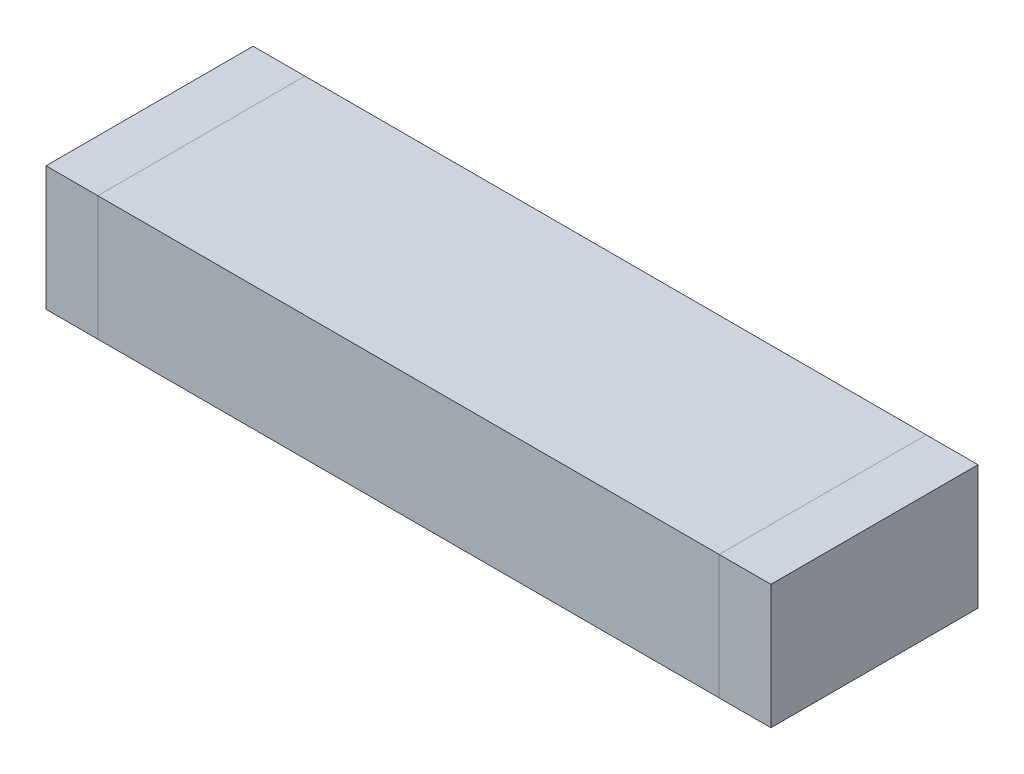
ISO-10303-21;
HEADER;
FILE_DESCRIPTION(('STEP AP214'),'2;1');
FILE_NAME('part.step','',(''),(''),'','','');
FILE_SCHEMA(('AUTOMOTIVE_DESIGN { 1 0 10303 214 1 1 1 1 }'));
ENDSEC;
DATA;
#1=APPLICATION_CONTEXT('core data for automotive mechanical design processes');
#2=APPLICATION_PROTOCOL_DEFINITION('international standard','automotive_design',2000,#1);
#3=PRODUCT_CONTEXT('',#1,'mechanical');
#4=PRODUCT('Part','Part','',(#3));
#5=PRODUCT_RELATED_PRODUCT_CATEGORY('part','',(#4));
#6=PRODUCT_DEFINITION_FORMATION('','',#4);
#7=PRODUCT_DEFINITION_CONTEXT('part definition',#1,'design');
#8=PRODUCT_DEFINITION('design','',#6,#7);
#9=PRODUCT_DEFINITION_SHAPE('','',#8);
#10=(LENGTH_UNIT() NAMED_UNIT(*) SI_UNIT(.MILLI.,.METRE.));
#11=(NAMED_UNIT(*) PLANE_ANGLE_UNIT() SI_UNIT($,.RADIAN.));
#12=(NAMED_UNIT(*) SI_UNIT($,.STERADIAN.) SOLID_ANGLE_UNIT());
#13=UNCERTAINTY_MEASURE_WITH_UNIT(LENGTH_MEASURE(1.E-05),#10,'distance_accuracy_value','');
#14=(GEOMETRIC_REPRESENTATION_CONTEXT(3) GLOBAL_UNCERTAINTY_ASSIGNED_CONTEXT((#13)) GLOBAL_UNIT_ASSIGNED_CONTEXT((#10,
#11,#12)) REPRESENTATION_CONTEXT('',''));
#15=CARTESIAN_POINT('',(0.,0.,0.));
#16=DIRECTION('',(0.,0.,1.));
#17=DIRECTION('',(1.,0.,0.));
#18=AXIS2_PLACEMENT_3D('',#15,#16,#17);
#19=CARTESIAN_POINT('',(-3.5,1.2,0.));
#20=DIRECTION('',(1.,0.,0.));
#21=DIRECTION('',(0.,0.,-1.));
#22=AXIS2_PLACEMENT_3D('',#19,#20,#21);
#23=PLANE('',#22);
#24=DIRECTION('',(0.,1.,0.));
#25=VECTOR('',#24,1.);
#26=CARTESIAN_POINT('',(-3.5,1.2,1.));
#27=LINE('',#26,#25);
#28=CARTESIAN_POINT('',(-3.5,1.2,1.));
#29=VERTEX_POINT('',#28);
#30=CARTESIAN_POINT('',(-3.5,0.,1.));
#31=VERTEX_POINT('',#30);
#32=EDGE_CURVE('P0_E19',#29,#31,#27,.F.);
#33=ORIENTED_EDGE('',*,*,#32,.F.);
#34=DIRECTION('',(0.,0.,1.));
#35=VECTOR('',#34,1.);
#36=CARTESIAN_POINT('',(-3.5,1.2,0.));
#37=LINE('',#36,#35);
#38=CARTESIAN_POINT('',(-3.5,1.2,-1.));
#39=VERTEX_POINT('',#38);
#40=EDGE_CURVE('P0_E68',#39,#29,#37,.T.);
#41=ORIENTED_EDGE('',*,*,#40,.F.);
#42=DIRECTION('',(0.,1.,0.));
#43=VECTOR('',#42,1.);
#44=CARTESIAN_POINT('',(-3.5,1.2,-1.));
#45=LINE('',#44,#43);
#46=CARTESIAN_POINT('',(-3.5,0.,-1.));
#47=VERTEX_POINT('',#46);
#48=EDGE_CURVE('P0_E55',#47,#39,#45,.T.);
#49=ORIENTED_EDGE('',*,*,#48,.F.);
#50=DIRECTION('',(0.,0.,1.));
#51=VECTOR('',#50,1.);
#52=CARTESIAN_POINT('',(-3.5,0.,0.));
#53=LINE('',#52,#51);
#54=EDGE_CURVE('P0_E61',#47,#31,#53,.T.);
#55=ORIENTED_EDGE('',*,*,#54,.T.);
#56=EDGE_LOOP('',(#33,#41,#49,#55));
#57=FACE_BOUND('',#56,.T.);
#58=ADVANCED_FACE('P0_F16',(#57),#23,.F.);
#59=CARTESIAN_POINT('',(0.,0.,0.));
#60=DIRECTION('',(0.,1.,0.));
#61=DIRECTION('',(0.,0.,1.));
#62=AXIS2_PLACEMENT_3D('',#59,#60,#61);
#63=PLANE('',#62);
#64=DIRECTION('',(-1.,0.,0.));
#65=VECTOR('',#64,1.);
#66=CARTESIAN_POINT('',(0.,0.,1.));
#67=LINE('',#66,#65);
#68=CARTESIAN_POINT('',(-3.,0.,1.));
#69=VERTEX_POINT('',#68);
#70=EDGE_CURVE('P0_E66',#69,#31,#67,.T.);
#71=ORIENTED_EDGE('',*,*,#70,.T.);
#72=ORIENTED_EDGE('',*,*,#54,.F.);
#73=DIRECTION('',(-1.,0.,0.));
#74=VECTOR('',#73,1.);
#75=CARTESIAN_POINT('',(0.,0.,-1.));
#76=LINE('',#75,#74);
#77=CARTESIAN_POINT('',(-3.,0.,-1.));
#78=VERTEX_POINT('',#77);
#79=EDGE_CURVE('P0_E63',#78,#47,#76,.T.);
#80=ORIENTED_EDGE('',*,*,#79,.F.);
#81=DIRECTION('',(0.,0.,-1.));
#82=VECTOR('',#81,1.);
#83=CARTESIAN_POINT('',(-3.,0.,0.));
#84=LINE('',#83,#82);
#85=EDGE_CURVE('P0_E82',#69,#78,#84,.T.);
#86=ORIENTED_EDGE('',*,*,#85,.F.);
#87=EDGE_LOOP('',(#71,#72,#80,#86));
#88=FACE_BOUND('',#87,.T.);
#89=ADVANCED_FACE('P0_F62',(#88),#63,.F.);
#90=CARTESIAN_POINT('',(0.,1.2,-1.));
#91=DIRECTION('',(0.,0.,-1.));
#92=DIRECTION('',(-1.,0.,0.));
#93=AXIS2_PLACEMENT_3D('',#90,#91,#92);
#94=PLANE('',#93);
#95=DIRECTION('',(1.,0.,0.));
#96=VECTOR('',#95,1.);
#97=CARTESIAN_POINT('',(0.,1.2,-1.));
#98=LINE('',#97,#96);
#99=CARTESIAN_POINT('',(-3.,1.2,-1.));
#100=VERTEX_POINT('',#99);
#101=EDGE_CURVE('P0_E70',#100,#39,#98,.F.);
#102=ORIENTED_EDGE('',*,*,#101,.F.);
#103=DIRECTION('',(0.,1.,0.));
#104=VECTOR('',#103,1.);
#105=CARTESIAN_POINT('',(-3.,1.2,-1.));
#106=LINE('',#105,#104);
#107=EDGE_CURVE('P0_E74',#78,#100,#106,.T.);
#108=ORIENTED_EDGE('',*,*,#107,.F.);
#109=ORIENTED_EDGE('',*,*,#79,.T.);
#110=ORIENTED_EDGE('',*,*,#48,.T.);
#111=EDGE_LOOP('',(#102,#108,#109,#110));
#112=FACE_BOUND('',#111,.T.);
#113=ADVANCED_FACE('P0_F72',(#112),#94,.T.);
#114=CARTESIAN_POINT('',(0.,1.2,0.));
#115=DIRECTION('',(0.,1.,0.));
#116=DIRECTION('',(0.,0.,1.));
#117=AXIS2_PLACEMENT_3D('',#114,#115,#116);
#118=PLANE('',#117);
#119=ORIENTED_EDGE('',*,*,#40,.T.);
#120=DIRECTION('',(-1.,0.,0.));
#121=VECTOR('',#120,1.);
#122=CARTESIAN_POINT('',(0.,1.2,1.));
#123=LINE('',#122,#121);
#124=CARTESIAN_POINT('',(-3.,1.2,1.));
#125=VERTEX_POINT('',#124);
#126=EDGE_CURVE('P0_E34',#29,#125,#123,.F.);
#127=ORIENTED_EDGE('',*,*,#126,.T.);
#128=DIRECTION('',(0.,0.,-1.));
#129=VECTOR('',#128,1.);
#130=CARTESIAN_POINT('',(-3.,1.2,0.));
#131=LINE('',#130,#129);
#132=EDGE_CURVE('P0_E25',#100,#125,#131,.F.);
#133=ORIENTED_EDGE('',*,*,#132,.F.);
#134=ORIENTED_EDGE('',*,*,#101,.T.);
#135=EDGE_LOOP('',(#119,#127,#133,#134));
#136=FACE_BOUND('',#135,.T.);
#137=ADVANCED_FACE('P0_F88',(#136),#118,.T.);
#138=CARTESIAN_POINT('',(0.,1.2,1.));
#139=DIRECTION('',(0.,0.,-1.));
#140=DIRECTION('',(-1.,0.,0.));
#141=AXIS2_PLACEMENT_3D('',#138,#139,#140);
#142=PLANE('',#141);
#143=DIRECTION('',(0.,1.,0.));
#144=VECTOR('',#143,1.);
#145=CARTESIAN_POINT('',(-3.,1.2,1.));
#146=LINE('',#145,#144);
#147=EDGE_CURVE('P0_E11',#125,#69,#146,.F.);
#148=ORIENTED_EDGE('',*,*,#147,.F.);
#149=ORIENTED_EDGE('',*,*,#126,.F.);
#150=ORIENTED_EDGE('',*,*,#32,.T.);
#151=ORIENTED_EDGE('',*,*,#70,.F.);
#152=EDGE_LOOP('',(#148,#149,#150,#151));
#153=FACE_BOUND('',#152,.T.);
#154=ADVANCED_FACE('P0_F90',(#153),#142,.F.);
#155=CARTESIAN_POINT('',(-3.,1.2,0.));
#156=DIRECTION('',(1.,0.,0.));
#157=DIRECTION('',(0.,0.,-1.));
#158=AXIS2_PLACEMENT_3D('',#155,#156,#157);
#159=PLANE('',#158);
#160=ORIENTED_EDGE('',*,*,#132,.T.);
#161=ORIENTED_EDGE('',*,*,#147,.T.);
#162=ORIENTED_EDGE('',*,*,#85,.T.);
#163=ORIENTED_EDGE('',*,*,#107,.T.);
#164=EDGE_LOOP('',(#160,#161,#162,#163));
#165=FACE_BOUND('',#164,.T.);
#166=ADVANCED_FACE('P0_F87',(#165),#159,.T.);
#167=CLOSED_SHELL('',(#58,#89,#113,#137,#154,#166));
#168=MANIFOLD_SOLID_BREP('P0_B1',#167);
#169=CARTESIAN_POINT('',(0.,0.,0.));
#170=DIRECTION('',(0.,1.,0.));
#171=DIRECTION('',(0.,0.,1.));
#172=AXIS2_PLACEMENT_3D('',#169,#170,#171);
#173=PLANE('',#172);
#174=DIRECTION('',(-1.,0.,0.));
#175=VECTOR('',#174,1.);
#176=CARTESIAN_POINT('',(0.,0.,1.));
#177=LINE('',#176,#175);
#178=CARTESIAN_POINT('',(3.,0.,1.));
#179=VERTEX_POINT('',#178);
#180=CARTESIAN_POINT('',(-3.,0.,1.));
#181=VERTEX_POINT('',#180);
#182=EDGE_CURVE('P1_E80',#179,#181,#177,.T.);
#183=ORIENTED_EDGE('',*,*,#182,.T.);
#184=DIRECTION('',(0.,0.,-1.));
#185=VECTOR('',#184,1.);
#186=CARTESIAN_POINT('',(-3.,0.,0.));
#187=LINE('',#186,#185);
#188=CARTESIAN_POINT('',(-3.,0.,-1.));
#189=VERTEX_POINT('',#188);
#190=EDGE_CURVE('P1_E60',#181,#189,#187,.T.);
#191=ORIENTED_EDGE('',*,*,#190,.T.);
#192=DIRECTION('',(-1.,0.,0.));
#193=VECTOR('',#192,1.);
#194=CARTESIAN_POINT('',(0.,0.,-1.));
#195=LINE('',#194,#193);
#196=CARTESIAN_POINT('',(3.,0.,-1.));
#197=VERTEX_POINT('',#196);
#198=EDGE_CURVE('P1_E54',#197,#189,#195,.T.);
#199=ORIENTED_EDGE('',*,*,#198,.F.);
#200=DIRECTION('',(0.,0.,-1.));
#201=VECTOR('',#200,1.);
#202=CARTESIAN_POINT('',(3.,0.,0.));
#203=LINE('',#202,#201);
#204=EDGE_CURVE('P1_E19',#179,#197,#203,.T.);
#205=ORIENTED_EDGE('',*,*,#204,.F.);
#206=EDGE_LOOP('',(#183,#191,#199,#205));
#207=FACE_BOUND('',#206,.T.);
#208=ADVANCED_FACE('P1_F16',(#207),#173,.F.);
#209=CARTESIAN_POINT('',(3.,1.2,0.));
#210=DIRECTION('',(1.,0.,0.));
#211=DIRECTION('',(0.,0.,-1.));
#212=AXIS2_PLACEMENT_3D('',#209,#210,#211);
#213=PLANE('',#212);
#214=DIRECTION('',(0.,0.,1.));
#215=VECTOR('',#214,1.);
#216=CARTESIAN_POINT('',(3.,1.2,0.));
#217=LINE('',#216,#215);
#218=CARTESIAN_POINT('',(3.,1.2,1.));
#219=VERTEX_POINT('',#218);
#220=CARTESIAN_POINT('',(3.,1.2,-1.));
#221=VERTEX_POINT('',#220);
#222=EDGE_CURVE('P1_E82',#219,#221,#217,.F.);
#223=ORIENTED_EDGE('',*,*,#222,.F.);
#224=DIRECTION('',(0.,1.,0.));
#225=VECTOR('',#224,1.);
#226=CARTESIAN_POINT('',(3.,1.2,1.));
#227=LINE('',#226,#225);
#228=EDGE_CURVE('P1_E67',#219,#179,#227,.F.);
#229=ORIENTED_EDGE('',*,*,#228,.T.);
#230=ORIENTED_EDGE('',*,*,#204,.T.);
#231=DIRECTION('',(0.,1.,0.));
#232=VECTOR('',#231,1.);
#233=CARTESIAN_POINT('',(3.,1.2,-1.));
#234=LINE('',#233,#232);
#235=EDGE_CURVE('P1_E62',#221,#197,#234,.F.);
#236=ORIENTED_EDGE('',*,*,#235,.F.);
#237=EDGE_LOOP('',(#223,#229,#230,#236));
#238=FACE_BOUND('',#237,.T.);
#239=ADVANCED_FACE('P1_F64',(#238),#213,.T.);
#240=CARTESIAN_POINT('',(0.,1.2,-1.));
#241=DIRECTION('',(0.,0.,-1.));
#242=DIRECTION('',(-1.,0.,0.));
#243=AXIS2_PLACEMENT_3D('',#240,#241,#242);
#244=PLANE('',#243);
#245=DIRECTION('',(1.,0.,0.));
#246=VECTOR('',#245,1.);
#247=CARTESIAN_POINT('',(0.,1.2,-1.));
#248=LINE('',#247,#246);
#249=CARTESIAN_POINT('',(-3.,1.2,-1.));
#250=VERTEX_POINT('',#249);
#251=EDGE_CURVE('P1_E71',#221,#250,#248,.F.);
#252=ORIENTED_EDGE('',*,*,#251,.F.);
#253=ORIENTED_EDGE('',*,*,#235,.T.);
#254=ORIENTED_EDGE('',*,*,#198,.T.);
#255=DIRECTION('',(0.,1.,0.));
#256=VECTOR('',#255,1.);
#257=CARTESIAN_POINT('',(-3.,1.2,-1.));
#258=LINE('',#257,#256);
#259=EDGE_CURVE('P1_E73',#189,#250,#258,.T.);
#260=ORIENTED_EDGE('',*,*,#259,.T.);
#261=EDGE_LOOP('',(#252,#253,#254,#260));
#262=FACE_BOUND('',#261,.T.);
#263=ADVANCED_FACE('P1_F69',(#262),#244,.T.);
#264=CARTESIAN_POINT('',(-3.,1.2,0.));
#265=DIRECTION('',(1.,0.,0.));
#266=DIRECTION('',(0.,0.,-1.));
#267=AXIS2_PLACEMENT_3D('',#264,#265,#266);
#268=PLANE('',#267);
#269=DIRECTION('',(0.,1.,0.));
#270=VECTOR('',#269,1.);
#271=CARTESIAN_POINT('',(-3.,1.2,1.));
#272=LINE('',#271,#270);
#273=CARTESIAN_POINT('',(-3.,1.2,1.));
#274=VERTEX_POINT('',#273);
#275=EDGE_CURVE('P1_E34',#181,#274,#272,.T.);
#276=ORIENTED_EDGE('',*,*,#275,.T.);
#277=DIRECTION('',(0.,0.,1.));
#278=VECTOR('',#277,1.);
#279=CARTESIAN_POINT('',(-3.,1.2,0.));
#280=LINE('',#279,#278);
#281=EDGE_CURVE('P1_E25',#250,#274,#280,.T.);
#282=ORIENTED_EDGE('',*,*,#281,.F.);
#283=ORIENTED_EDGE('',*,*,#259,.F.);
#284=ORIENTED_EDGE('',*,*,#190,.F.);
#285=EDGE_LOOP('',(#276,#282,#283,#284));
#286=FACE_BOUND('',#285,.T.);
#287=ADVANCED_FACE('P1_F88',(#286),#268,.F.);
#288=CARTESIAN_POINT('',(0.,1.2,1.));
#289=DIRECTION('',(0.,0.,-1.));
#290=DIRECTION('',(-1.,0.,0.));
#291=AXIS2_PLACEMENT_3D('',#288,#289,#290);
#292=PLANE('',#291);
#293=ORIENTED_EDGE('',*,*,#228,.F.);
#294=DIRECTION('',(1.,0.,0.));
#295=VECTOR('',#294,1.);
#296=CARTESIAN_POINT('',(0.,1.2,1.));
#297=LINE('',#296,#295);
#298=EDGE_CURVE('P1_E11',#274,#219,#297,.T.);
#299=ORIENTED_EDGE('',*,*,#298,.F.);
#300=ORIENTED_EDGE('',*,*,#275,.F.);
#301=ORIENTED_EDGE('',*,*,#182,.F.);
#302=EDGE_LOOP('',(#293,#299,#300,#301));
#303=FACE_BOUND('',#302,.T.);
#304=ADVANCED_FACE('P1_F90',(#303),#292,.F.);
#305=CARTESIAN_POINT('',(0.,1.2,0.));
#306=DIRECTION('',(0.,1.,0.));
#307=DIRECTION('',(0.,0.,1.));
#308=AXIS2_PLACEMENT_3D('',#305,#306,#307);
#309=PLANE('',#308);
#310=ORIENTED_EDGE('',*,*,#281,.T.);
#311=ORIENTED_EDGE('',*,*,#298,.T.);
#312=ORIENTED_EDGE('',*,*,#222,.T.);
#313=ORIENTED_EDGE('',*,*,#251,.T.);
#314=EDGE_LOOP('',(#310,#311,#312,#313));
#315=FACE_BOUND('',#314,.T.);
#316=ADVANCED_FACE('P1_F87',(#315),#309,.T.);
#317=CLOSED_SHELL('',(#208,#239,#263,#287,#304,#316));
#318=MANIFOLD_SOLID_BREP('P1_B1',#317);
#319=CARTESIAN_POINT('',(3.5,1.2,0.));
#320=DIRECTION('',(1.,0.,0.));
#321=DIRECTION('',(0.,0.,-1.));
#322=AXIS2_PLACEMENT_3D('',#319,#320,#321);
#323=PLANE('',#322);
#324=DIRECTION('',(0.,0.,1.));
#325=VECTOR('',#324,1.);
#326=CARTESIAN_POINT('',(3.5,1.2,0.));
#327=LINE('',#326,#325);
#328=CARTESIAN_POINT('',(3.5,1.2,1.));
#329=VERTEX_POINT('',#328);
#330=CARTESIAN_POINT('',(3.5,1.2,-1.));
#331=VERTEX_POINT('',#330);
#332=EDGE_CURVE('P2_E54',#329,#331,#327,.F.);
#333=ORIENTED_EDGE('',*,*,#332,.F.);
#334=DIRECTION('',(0.,1.,0.));
#335=VECTOR('',#334,1.);
#336=CARTESIAN_POINT('',(3.5,1.2,1.));
#337=LINE('',#336,#335);
#338=CARTESIAN_POINT('',(3.5,0.,1.));
#339=VERTEX_POINT('',#338);
#340=EDGE_CURVE('P2_E73',#329,#339,#337,.F.);
#341=ORIENTED_EDGE('',*,*,#340,.T.);
#342=DIRECTION('',(0.,0.,1.));
#343=VECTOR('',#342,1.);
#344=CARTESIAN_POINT('',(3.5,0.,0.));
#345=LINE('',#344,#343);
#346=CARTESIAN_POINT('',(3.5,0.,-1.));
#347=VERTEX_POINT('',#346);
#348=EDGE_CURVE('P2_E65',#339,#347,#345,.F.);
#349=ORIENTED_EDGE('',*,*,#348,.T.);
#350=DIRECTION('',(0.,1.,0.));
#351=VECTOR('',#350,1.);
#352=CARTESIAN_POINT('',(3.5,1.2,-1.));
#353=LINE('',#352,#351);
#354=EDGE_CURVE('P2_E19',#331,#347,#353,.F.);
#355=ORIENTED_EDGE('',*,*,#354,.F.);
#356=EDGE_LOOP('',(#333,#341,#349,#355));
#357=FACE_BOUND('',#356,.T.);
#358=ADVANCED_FACE('P2_F16',(#357),#323,.T.);
#359=CARTESIAN_POINT('',(0.,1.2,-1.));
#360=DIRECTION('',(0.,0.,-1.));
#361=DIRECTION('',(-1.,0.,0.));
#362=AXIS2_PLACEMENT_3D('',#359,#360,#361);
#363=PLANE('',#362);
#364=DIRECTION('',(1.,0.,0.));
#365=VECTOR('',#364,1.);
#366=CARTESIAN_POINT('',(0.,1.2,-1.));
#367=LINE('',#366,#365);
#368=CARTESIAN_POINT('',(3.,1.2,-1.));
#369=VERTEX_POINT('',#368);
#370=EDGE_CURVE('P2_E61',#331,#369,#367,.F.);
#371=ORIENTED_EDGE('',*,*,#370,.F.);
#372=ORIENTED_EDGE('',*,*,#354,.T.);
#373=DIRECTION('',(1.,0.,0.));
#374=VECTOR('',#373,1.);
#375=CARTESIAN_POINT('',(0.,0.,-1.));
#376=LINE('',#375,#374);
#377=CARTESIAN_POINT('',(3.,0.,-1.));
#378=VERTEX_POINT('',#377);
#379=EDGE_CURVE('P2_E79',#347,#378,#376,.F.);
#380=ORIENTED_EDGE('',*,*,#379,.T.);
#381=DIRECTION('',(0.,1.,0.));
#382=VECTOR('',#381,1.);
#383=CARTESIAN_POINT('',(3.,1.2,-1.));
#384=LINE('',#383,#382);
#385=EDGE_CURVE('P2_E71',#378,#369,#384,.T.);
#386=ORIENTED_EDGE('',*,*,#385,.T.);
#387=EDGE_LOOP('',(#371,#372,#380,#386));
#388=FACE_BOUND('',#387,.T.);
#389=ADVANCED_FACE('P2_F70',(#388),#363,.T.);
#390=CARTESIAN_POINT('',(0.,1.2,0.));
#391=DIRECTION('',(0.,1.,0.));
#392=DIRECTION('',(0.,0.,1.));
#393=AXIS2_PLACEMENT_3D('',#390,#391,#392);
#394=PLANE('',#393);
#395=ORIENTED_EDGE('',*,*,#332,.T.);
#396=ORIENTED_EDGE('',*,*,#370,.T.);
#397=DIRECTION('',(0.,0.,-1.));
#398=VECTOR('',#397,1.);
#399=CARTESIAN_POINT('',(3.,1.2,0.));
#400=LINE('',#399,#398);
#401=CARTESIAN_POINT('',(3.,1.2,1.));
#402=VERTEX_POINT('',#401);
#403=EDGE_CURVE('P2_E82',#369,#402,#400,.F.);
#404=ORIENTED_EDGE('',*,*,#403,.T.);
#405=DIRECTION('',(-1.,0.,0.));
#406=VECTOR('',#405,1.);
#407=CARTESIAN_POINT('',(0.,1.2,1.));
#408=LINE('',#407,#406);
#409=EDGE_CURVE('P2_E63',#402,#329,#408,.F.);
#410=ORIENTED_EDGE('',*,*,#409,.T.);
#411=EDGE_LOOP('',(#395,#396,#404,#410));
#412=FACE_BOUND('',#411,.T.);
#413=ADVANCED_FACE('P2_F58',(#412),#394,.T.);
#414=CARTESIAN_POINT('',(0.,1.2,1.));
#415=DIRECTION('',(0.,0.,-1.));
#416=DIRECTION('',(-1.,0.,0.));
#417=AXIS2_PLACEMENT_3D('',#414,#415,#416);
#418=PLANE('',#417);
#419=ORIENTED_EDGE('',*,*,#340,.F.);
#420=ORIENTED_EDGE('',*,*,#409,.F.);
#421=DIRECTION('',(0.,1.,0.));
#422=VECTOR('',#421,1.);
#423=CARTESIAN_POINT('',(3.,1.2,1.));
#424=LINE('',#423,#422);
#425=CARTESIAN_POINT('',(3.,0.,1.));
#426=VERTEX_POINT('',#425);
#427=EDGE_CURVE('P2_E25',#402,#426,#424,.F.);
#428=ORIENTED_EDGE('',*,*,#427,.T.);
#429=DIRECTION('',(1.,0.,0.));
#430=VECTOR('',#429,1.);
#431=CARTESIAN_POINT('',(0.,0.,1.));
#432=LINE('',#431,#430);
#433=EDGE_CURVE('P2_E33',#426,#339,#432,.T.);
#434=ORIENTED_EDGE('',*,*,#433,.T.);
#435=EDGE_LOOP('',(#419,#420,#428,#434));
#436=FACE_BOUND('',#435,.T.);
#437=ADVANCED_FACE('P2_F87',(#436),#418,.F.);
#438=CARTESIAN_POINT('',(0.,0.,0.));
#439=DIRECTION('',(0.,1.,0.));
#440=DIRECTION('',(0.,0.,1.));
#441=AXIS2_PLACEMENT_3D('',#438,#439,#440);
#442=PLANE('',#441);
#443=ORIENTED_EDGE('',*,*,#379,.F.);
#444=ORIENTED_EDGE('',*,*,#348,.F.);
#445=ORIENTED_EDGE('',*,*,#433,.F.);
#446=DIRECTION('',(0.,0.,-1.));
#447=VECTOR('',#446,1.);
#448=CARTESIAN_POINT('',(3.,0.,0.));
#449=LINE('',#448,#447);
#450=EDGE_CURVE('P2_E11',#426,#378,#449,.T.);
#451=ORIENTED_EDGE('',*,*,#450,.T.);
#452=EDGE_LOOP('',(#443,#444,#445,#451));
#453=FACE_BOUND('',#452,.T.);
#454=ADVANCED_FACE('P2_F90',(#453),#442,.F.);
#455=CARTESIAN_POINT('',(3.,1.2,0.));
#456=DIRECTION('',(1.,0.,0.));
#457=DIRECTION('',(0.,0.,-1.));
#458=AXIS2_PLACEMENT_3D('',#455,#456,#457);
#459=PLANE('',#458);
#460=ORIENTED_EDGE('',*,*,#427,.F.);
#461=ORIENTED_EDGE('',*,*,#403,.F.);
#462=ORIENTED_EDGE('',*,*,#385,.F.);
#463=ORIENTED_EDGE('',*,*,#450,.F.);
#464=EDGE_LOOP('',(#460,#461,#462,#463));
#465=FACE_BOUND('',#464,.T.);
#466=ADVANCED_FACE('P2_F89',(#465),#459,.F.);
#467=CLOSED_SHELL('',(#358,#389,#413,#437,#454,#466));
#468=MANIFOLD_SOLID_BREP('P2_B1',#467);
#469=ADVANCED_BREP_SHAPE_REPRESENTATION('',(#18,#168,#318,#468),#14);
#470=SHAPE_DEFINITION_REPRESENTATION(#9,#469);
ENDSEC;
END-ISO-10303-21;
